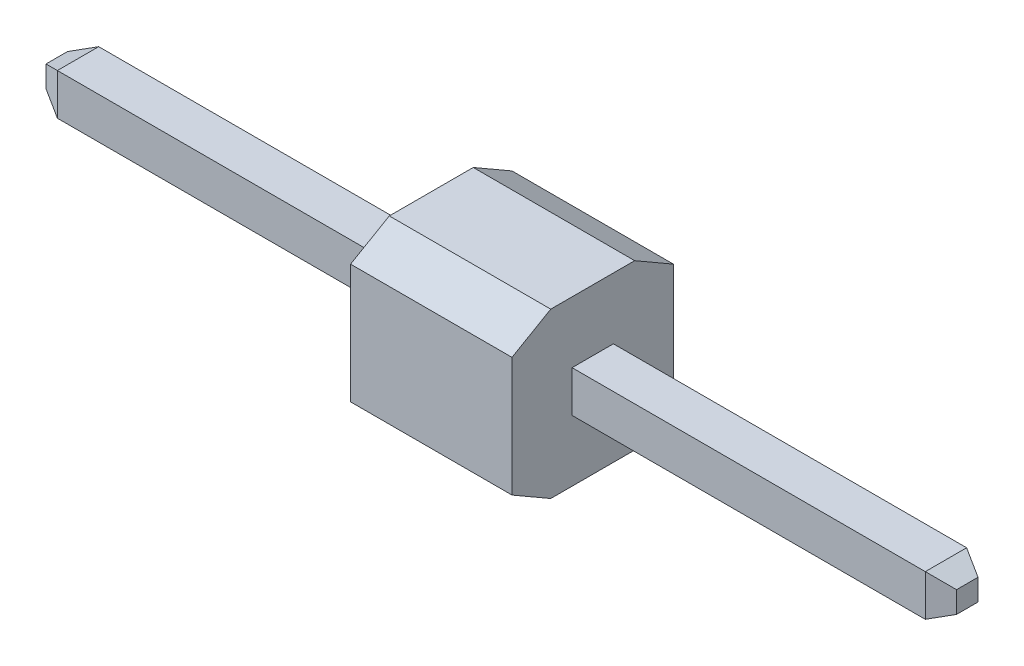
ISO-10303-21;
HEADER;
FILE_DESCRIPTION(('STEP AP214'),'2;1');
FILE_NAME('part.step','',(''),(''),'','','');
FILE_SCHEMA(('AUTOMOTIVE_DESIGN { 1 0 10303 214 1 1 1 1 }'));
ENDSEC;
DATA;
#1=APPLICATION_CONTEXT('core data for automotive mechanical design processes');
#2=APPLICATION_PROTOCOL_DEFINITION('international standard','automotive_design',2000,#1);
#3=PRODUCT_CONTEXT('',#1,'mechanical');
#4=PRODUCT('Part','Part','',(#3));
#5=PRODUCT_RELATED_PRODUCT_CATEGORY('part','',(#4));
#6=PRODUCT_DEFINITION_FORMATION('','',#4);
#7=PRODUCT_DEFINITION_CONTEXT('part definition',#1,'design');
#8=PRODUCT_DEFINITION('design','',#6,#7);
#9=PRODUCT_DEFINITION_SHAPE('','',#8);
#10=(LENGTH_UNIT() NAMED_UNIT(*) SI_UNIT(.MILLI.,.METRE.));
#11=(NAMED_UNIT(*) PLANE_ANGLE_UNIT() SI_UNIT($,.RADIAN.));
#12=(NAMED_UNIT(*) SI_UNIT($,.STERADIAN.) SOLID_ANGLE_UNIT());
#13=UNCERTAINTY_MEASURE_WITH_UNIT(LENGTH_MEASURE(1.E-05),#10,'distance_accuracy_value','');
#14=(GEOMETRIC_REPRESENTATION_CONTEXT(3) GLOBAL_UNCERTAINTY_ASSIGNED_CONTEXT((#13)) GLOBAL_UNIT_ASSIGNED_CONTEXT((#10,
#11,#12)) REPRESENTATION_CONTEXT('',''));
#15=CARTESIAN_POINT('',(0.,0.,0.));
#16=DIRECTION('',(0.,0.,1.));
#17=DIRECTION('',(1.,0.,0.));
#18=AXIS2_PLACEMENT_3D('',#15,#16,#17);
#19=CARTESIAN_POINT('',(5.42107716618497,15.5571157260571,-2.77112192788788));
#20=DIRECTION('',(1.,-9.93476518829084E-08,4.37113882867379E-08));
#21=DIRECTION('',(-9.93476589883358E-08,-1.,8.74227765734759E-08));
#22=AXIS2_PLACEMENT_3D('',#19,#20,#21);
#23=PLANE('',#22);
#24=DIRECTION('',(-1.18186632779336E-08,-0.500000075710541,-0.866025360072933));
#25=VECTOR('',#24,1.);
#26=CARTESIAN_POINT('',(5.42107697401036,14.3135260248209,-1.2011218191698));
#27=LINE('',#26,#25);
#28=CARTESIAN_POINT('',(5.42107697401036,14.3135260248209,-1.2011218191698));
#29=VERTEX_POINT('',#28);
#30=CARTESIAN_POINT('',(5.42107696582215,13.9671158108572,-1.80112178888567));
#31=VERTEX_POINT('',#30);
#32=EDGE_CURVE('E11',#29,#31,#27,.T.);
#33=ORIENTED_EDGE('',*,*,#32,.T.);
#34=DIRECTION('',(4.37113811813104E-08,-8.74227842254741E-08,-0.999999999999995));
#35=VECTOR('',#34,1.);
#36=CARTESIAN_POINT('',(5.42107696582215,13.9671158108572,-1.80112178888567));
#37=LINE('',#36,#35);
#38=CARTESIAN_POINT('',(5.42107702264695,13.9671156972076,-3.10112178888567));
#39=VERTEX_POINT('',#38);
#40=EDGE_CURVE('E304',#31,#39,#37,.T.);
#41=ORIENTED_EDGE('',*,*,#40,.T.);
#42=DIRECTION('',(8.75289963531795E-08,0.499999924289839,-0.866025447495711));
#43=VECTOR('',#42,1.);
#44=CARTESIAN_POINT('',(5.42107702264695,13.9671156972076,-3.10112178888567));
#45=LINE('',#44,#43);
#46=CARTESIAN_POINT('',(5.42107708328881,14.313525806264,-3.7011218191698));
#47=VERTEX_POINT('',#46);
#48=EDGE_CURVE('E296',#39,#47,#45,.T.);
#49=ORIENTED_EDGE('',*,*,#48,.T.);
#50=DIRECTION('',(9.93476588436476E-08,0.999999999999991,-8.74227767226933E-08));
#51=VECTOR('',#50,1.);
#52=CARTESIAN_POINT('',(5.42107708328881,14.313525806264,-3.7011218191698));
#53=LINE('',#52,#51);
#54=CARTESIAN_POINT('',(5.42107726680179,16.160705483234,-3.70112198065538));
#55=VERTEX_POINT('',#54);
#56=EDGE_CURVE('E281',#47,#55,#53,.T.);
#57=ORIENTED_EDGE('',*,*,#56,.T.);
#58=DIRECTION('',(-1.18186619958731E-08,-0.500000075710537,-0.866025360072935));
#59=VECTOR('',#58,1.);
#60=CARTESIAN_POINT('',(5.42107727499,16.5071156972076,-3.10112201093952));
#61=LINE('',#60,#59);
#62=CARTESIAN_POINT('',(5.42107727499,16.5071156972076,-3.10112201093952));
#63=VERTEX_POINT('',#62);
#64=EDGE_CURVE('E265',#63,#55,#61,.T.);
#65=ORIENTED_EDGE('',*,*,#64,.F.);
#66=DIRECTION('',(4.37113811813104E-08,-8.74227842254741E-08,-0.999999999999995));
#67=VECTOR('',#66,1.);
#68=CARTESIAN_POINT('',(5.42107721816521,16.5071158108572,-1.80112201093952));
#69=LINE('',#68,#67);
#70=CARTESIAN_POINT('',(5.42107721816521,16.5071158108572,-1.80112201093952));
#71=VERTEX_POINT('',#70);
#72=EDGE_CURVE('E248',#71,#63,#69,.T.);
#73=ORIENTED_EDGE('',*,*,#72,.F.);
#74=DIRECTION('',(8.7528996352548E-08,0.499999924289832,-0.866025447495716));
#75=VECTOR('',#74,1.);
#76=CARTESIAN_POINT('',(5.42107715752334,16.1607057017909,-1.20112198065538));
#77=LINE('',#76,#75);
#78=CARTESIAN_POINT('',(5.42107715752334,16.1607057017909,-1.20112198065538));
#79=VERTEX_POINT('',#78);
#80=EDGE_CURVE('E242',#79,#71,#77,.T.);
#81=ORIENTED_EDGE('',*,*,#80,.F.);
#82=DIRECTION('',(9.93476588436476E-08,0.999999999999991,-8.74227762418639E-08));
#83=VECTOR('',#82,1.);
#84=CARTESIAN_POINT('',(5.42107697401036,14.3135260248209,-1.2011218191698));
#85=LINE('',#84,#83);
#86=EDGE_CURVE('E236',#29,#79,#85,.T.);
#87=ORIENTED_EDGE('',*,*,#86,.F.);
#88=EDGE_LOOP('',(#33,#41,#49,#57,#65,#73,#81,#87));
#89=FACE_BOUND('',#88,.T.);
#90=DIRECTION('',(-4.37113817364219E-08,8.74227856773042E-08,0.999999999999995));
#91=VECTOR('',#90,1.);
#92=CARTESIAN_POINT('',(5.42107710260247,14.9171157260571,-2.7711218719373));
#93=LINE('',#92,#91);
#94=CARTESIAN_POINT('',(5.42107710260247,14.9171157260571,-2.7711218719373));
#95=VERTEX_POINT('',#94);
#96=CARTESIAN_POINT('',(5.42107707462718,14.9171157820077,-2.1311218719373));
#97=VERTEX_POINT('',#96);
#98=EDGE_CURVE('E302',#95,#97,#93,.T.);
#99=ORIENTED_EDGE('',*,*,#98,.T.);
#100=DIRECTION('',(-9.93476592658906E-08,-0.999999999999991,8.74227766567418E-08));
#101=VECTOR('',#100,1.);
#102=CARTESIAN_POINT('',(5.42107713820968,15.5571157820077,-2.13112192788788));
#103=LINE('',#102,#101);
#104=CARTESIAN_POINT('',(5.42107713820968,15.5571157820077,-2.13112192788788));
#105=VERTEX_POINT('',#104);
#106=EDGE_CURVE('E293',#105,#97,#103,.T.);
#107=ORIENTED_EDGE('',*,*,#106,.F.);
#108=DIRECTION('',(-4.37113817364219E-08,8.74227912284194E-08,0.999999999999995));
#109=VECTOR('',#108,1.);
#110=CARTESIAN_POINT('',(5.42107716618497,15.5571157260571,-2.77112192788788));
#111=LINE('',#110,#109);
#112=CARTESIAN_POINT('',(5.42107716618497,15.5571157260571,-2.77112192788788));
#113=VERTEX_POINT('',#112);
#114=EDGE_CURVE('E278',#113,#105,#111,.T.);
#115=ORIENTED_EDGE('',*,*,#114,.F.);
#116=DIRECTION('',(-9.93476592658906E-08,-0.999999999999991,8.74227759628524E-08));
#117=VECTOR('',#116,1.);
#118=CARTESIAN_POINT('',(5.42107716618497,15.5571157260571,-2.77112192788788));
#119=LINE('',#118,#117);
#120=EDGE_CURVE('E263',#113,#95,#119,.T.);
#121=ORIENTED_EDGE('',*,*,#120,.T.);
#122=EDGE_LOOP('',(#99,#107,#115,#121));
#123=FACE_BOUND('',#122,.T.);
#124=ADVANCED_FACE('F17',(#89,#123),#23,.T.);
#125=CARTESIAN_POINT('',(2.92107716618497,15.5571159744263,-2.77112203716635));
#126=DIRECTION('',(1.,-9.93476518829084E-08,4.37113882867379E-08));
#127=DIRECTION('',(-9.93476589883358E-08,-1.,8.74227765734759E-08));
#128=AXIS2_PLACEMENT_3D('',#125,#126,#127);
#129=PLANE('',#128);
#130=DIRECTION('',(-1.18186632779336E-08,-0.500000075710541,-0.866025360072933));
#131=VECTOR('',#130,1.);
#132=CARTESIAN_POINT('',(2.92107697401036,14.31352627319,-1.20112192844828));
#133=LINE('',#132,#131);
#134=CARTESIAN_POINT('',(2.92107697401036,14.31352627319,-1.20112192844828));
#135=VERTEX_POINT('',#134);
#136=CARTESIAN_POINT('',(2.92107696582215,13.9671160592264,-1.80112189816414));
#137=VERTEX_POINT('',#136);
#138=EDGE_CURVE('E24',#135,#137,#133,.T.);
#139=ORIENTED_EDGE('',*,*,#138,.F.);
#140=DIRECTION('',(9.93476588436476E-08,0.999999999999991,-8.74227762418639E-08));
#141=VECTOR('',#140,1.);
#142=CARTESIAN_POINT('',(2.92107697401036,14.31352627319,-1.20112192844828));
#143=LINE('',#142,#141);
#144=CARTESIAN_POINT('',(2.92107715752334,16.16070595016,-1.20112208993385));
#145=VERTEX_POINT('',#144);
#146=EDGE_CURVE('E300',#135,#145,#143,.T.);
#147=ORIENTED_EDGE('',*,*,#146,.T.);
#148=DIRECTION('',(8.7528996352548E-08,0.499999924289832,-0.866025447495716));
#149=VECTOR('',#148,1.);
#150=CARTESIAN_POINT('',(2.92107715752334,16.16070595016,-1.20112208993385));
#151=LINE('',#150,#149);
#152=CARTESIAN_POINT('',(2.92107721816521,16.5071160592264,-1.80112212021799));
#153=VERTEX_POINT('',#152);
#154=EDGE_CURVE('E286',#145,#153,#151,.T.);
#155=ORIENTED_EDGE('',*,*,#154,.T.);
#156=DIRECTION('',(4.37113811813104E-08,-8.74227842254741E-08,-0.999999999999995));
#157=VECTOR('',#156,1.);
#158=CARTESIAN_POINT('',(2.92107721816521,16.5071160592264,-1.80112212021799));
#159=LINE('',#158,#157);
#160=CARTESIAN_POINT('',(2.92107727499,16.5071159455768,-3.10112212021799));
#161=VERTEX_POINT('',#160);
#162=EDGE_CURVE('E271',#153,#161,#159,.T.);
#163=ORIENTED_EDGE('',*,*,#162,.T.);
#164=DIRECTION('',(-1.18186626368607E-08,-0.500000075710537,-0.866025360072935));
#165=VECTOR('',#164,1.);
#166=CARTESIAN_POINT('',(2.92107727499,16.5071159455768,-3.10112212021799));
#167=LINE('',#166,#165);
#168=CARTESIAN_POINT('',(2.92107726680179,16.1607057316031,-3.70112208993385));
#169=VERTEX_POINT('',#168);
#170=EDGE_CURVE('E253',#161,#169,#167,.T.);
#171=ORIENTED_EDGE('',*,*,#170,.T.);
#172=DIRECTION('',(9.93476588436476E-08,0.999999999999991,-8.74227767226933E-08));
#173=VECTOR('',#172,1.);
#174=CARTESIAN_POINT('',(2.92107708328881,14.3135260546331,-3.70112192844828));
#175=LINE('',#174,#173);
#176=CARTESIAN_POINT('',(2.92107708328881,14.3135260546331,-3.70112192844828));
#177=VERTEX_POINT('',#176);
#178=EDGE_CURVE('E261',#177,#169,#175,.T.);
#179=ORIENTED_EDGE('',*,*,#178,.F.);
#180=DIRECTION('',(8.75289963531795E-08,0.499999924289839,-0.866025447495711));
#181=VECTOR('',#180,1.);
#182=CARTESIAN_POINT('',(2.92107702264695,13.9671159455768,-3.10112189816414));
#183=LINE('',#182,#181);
#184=CARTESIAN_POINT('',(2.92107702264695,13.9671159455768,-3.10112189816414));
#185=VERTEX_POINT('',#184);
#186=EDGE_CURVE('E276',#185,#177,#183,.T.);
#187=ORIENTED_EDGE('',*,*,#186,.F.);
#188=DIRECTION('',(4.37113811813104E-08,-8.74227842254741E-08,-0.999999999999995));
#189=VECTOR('',#188,1.);
#190=CARTESIAN_POINT('',(2.92107696582215,13.9671160592264,-1.80112189816414));
#191=LINE('',#190,#189);
#192=EDGE_CURVE('E291',#137,#185,#191,.T.);
#193=ORIENTED_EDGE('',*,*,#192,.F.);
#194=EDGE_LOOP('',(#139,#147,#155,#163,#171,#179,#187,#193));
#195=FACE_BOUND('',#194,.T.);
#196=DIRECTION('',(-9.93476585720012E-08,-0.999999999999991,8.74227766567418E-08));
#197=VECTOR('',#196,1.);
#198=CARTESIAN_POINT('',(2.92107713820968,15.5571160303769,-2.13112203716635));
#199=LINE('',#198,#197);
#200=CARTESIAN_POINT('',(2.92107713820968,15.5571160303769,-2.13112203716635));
#201=VERTEX_POINT('',#200);
#202=CARTESIAN_POINT('',(2.92107707462718,14.9171160303769,-2.13112198121578));
#203=VERTEX_POINT('',#202);
#204=EDGE_CURVE('E298',#201,#203,#199,.T.);
#205=ORIENTED_EDGE('',*,*,#204,.T.);
#206=DIRECTION('',(-4.37113810425325E-08,8.74227856773042E-08,0.999999999999995));
#207=VECTOR('',#206,1.);
#208=CARTESIAN_POINT('',(2.92107710260247,14.9171159744263,-2.77112198121578));
#209=LINE('',#208,#207);
#210=CARTESIAN_POINT('',(2.92107710260247,14.9171159744263,-2.77112198121578));
#211=VERTEX_POINT('',#210);
#212=EDGE_CURVE('E283',#211,#203,#209,.T.);
#213=ORIENTED_EDGE('',*,*,#212,.F.);
#214=DIRECTION('',(-9.93476592658906E-08,-0.999999999999991,8.74227759628524E-08));
#215=VECTOR('',#214,1.);
#216=CARTESIAN_POINT('',(2.92107716618497,15.5571159744263,-2.77112203716635));
#217=LINE('',#216,#215);
#218=CARTESIAN_POINT('',(2.92107716618497,15.5571159744263,-2.77112203716635));
#219=VERTEX_POINT('',#218);
#220=EDGE_CURVE('E268',#219,#211,#217,.T.);
#221=ORIENTED_EDGE('',*,*,#220,.F.);
#222=DIRECTION('',(-4.37113817364219E-08,8.74227912284194E-08,0.999999999999995));
#223=VECTOR('',#222,1.);
#224=CARTESIAN_POINT('',(2.92107716618497,15.5571159744263,-2.77112203716635));
#225=LINE('',#224,#223);
#226=EDGE_CURVE('E251',#219,#201,#225,.T.);
#227=ORIENTED_EDGE('',*,*,#226,.T.);
#228=EDGE_LOOP('',(#205,#213,#221,#227));
#229=FACE_BOUND('',#228,.T.);
#230=ADVANCED_FACE('F314',(#195,#229),#129,.F.);
#231=CARTESIAN_POINT('',(5.42107697401036,14.3135260248209,-1.2011218191698));
#232=DIRECTION('',(1.07893287081065E-07,0.866025360072937,-0.500000075710535));
#233=DIRECTION('',(1.18186629566715E-08,0.500000075710542,0.866025360072941));
#234=AXIS2_PLACEMENT_3D('',#231,#232,#233);
#235=PLANE('',#234);
#236=ORIENTED_EDGE('',*,*,#138,.T.);
#237=DIRECTION('',(-0.999999999999994,9.93476490407369E-08,-4.37113882867377E-08));
#238=VECTOR('',#237,1.);
#239=CARTESIAN_POINT('',(5.42107696582215,13.9671158108572,-1.80112178888567));
#240=LINE('',#239,#238);
#241=EDGE_CURVE('E288',#31,#137,#240,.T.);
#242=ORIENTED_EDGE('',*,*,#241,.F.);
#243=ORIENTED_EDGE('',*,*,#32,.F.);
#244=DIRECTION('',(-0.999999999999994,9.93476533039933E-08,-4.3711388109102E-08));
#245=VECTOR('',#244,1.);
#246=CARTESIAN_POINT('',(5.42107697401036,14.3135260248209,-1.2011218191698));
#247=LINE('',#246,#245);
#248=EDGE_CURVE('E256',#29,#135,#247,.T.);
#249=ORIENTED_EDGE('',*,*,#248,.T.);
#250=EDGE_LOOP('',(#236,#242,#243,#249));
#251=FACE_BOUND('',#250,.T.);
#252=ADVANCED_FACE('F306',(#251),#235,.F.);
#253=CARTESIAN_POINT('',(5.42107696582215,13.9671158108572,-1.80112178888567));
#254=DIRECTION('',(9.93476589883358E-08,1.,-8.74227765734759E-08));
#255=DIRECTION('',(1.,-9.93476518829084E-08,4.37113882867379E-08));
#256=AXIS2_PLACEMENT_3D('',#253,#254,#255);
#257=PLANE('',#256);
#258=ORIENTED_EDGE('',*,*,#192,.T.);
#259=DIRECTION('',(-0.999999999999994,9.93476490407369E-08,-4.37113882867377E-08));
#260=VECTOR('',#259,1.);
#261=CARTESIAN_POINT('',(5.42107702264695,13.9671156972076,-3.10112178888567));
#262=LINE('',#261,#260);
#263=EDGE_CURVE('E273',#39,#185,#262,.T.);
#264=ORIENTED_EDGE('',*,*,#263,.F.);
#265=ORIENTED_EDGE('',*,*,#40,.F.);
#266=ORIENTED_EDGE('',*,*,#241,.T.);
#267=EDGE_LOOP('',(#258,#264,#265,#266));
#268=FACE_BOUND('',#267,.T.);
#269=ADVANCED_FACE('F311',(#268),#257,.F.);
#270=CARTESIAN_POINT('',(5.42107702264695,13.9671156972076,-3.10112178888567));
#271=DIRECTION('',(6.41819058997377E-08,0.866025447495721,0.499999924289845));
#272=DIRECTION('',(-8.7528996031702E-08,-0.499999924289838,0.866025447495717));
#273=AXIS2_PLACEMENT_3D('',#270,#271,#272);
#274=PLANE('',#273);
#275=ORIENTED_EDGE('',*,*,#186,.T.);
#276=DIRECTION('',(-0.999999999999994,9.93476533039933E-08,-4.37113884643734E-08));
#277=VECTOR('',#276,1.);
#278=CARTESIAN_POINT('',(5.42107708328881,14.313525806264,-3.7011218191698));
#279=LINE('',#278,#277);
#280=EDGE_CURVE('E258',#47,#177,#279,.T.);
#281=ORIENTED_EDGE('',*,*,#280,.F.);
#282=ORIENTED_EDGE('',*,*,#48,.F.);
#283=ORIENTED_EDGE('',*,*,#263,.T.);
#284=EDGE_LOOP('',(#275,#281,#282,#283));
#285=FACE_BOUND('',#284,.T.);
#286=ADVANCED_FACE('F319',(#285),#274,.F.);
#287=CARTESIAN_POINT('',(5.42107708328881,14.313525806264,-3.7011218191698));
#288=DIRECTION('',(-4.37113811813106E-08,8.74227836789032E-08,1.));
#289=DIRECTION('',(-1.,9.93476518829084E-08,-4.37113882867379E-08));
#290=AXIS2_PLACEMENT_3D('',#287,#288,#289);
#291=PLANE('',#290);
#292=ORIENTED_EDGE('',*,*,#178,.T.);
#293=DIRECTION('',(-0.999999999999994,9.93476533039933E-08,-4.37113882867377E-08));
#294=VECTOR('',#293,1.);
#295=CARTESIAN_POINT('',(5.42107726680179,16.160705483234,-3.70112198065538));
#296=LINE('',#295,#294);
#297=EDGE_CURVE('E245',#55,#169,#296,.T.);
#298=ORIENTED_EDGE('',*,*,#297,.F.);
#299=ORIENTED_EDGE('',*,*,#56,.F.);
#300=ORIENTED_EDGE('',*,*,#280,.T.);
#301=EDGE_LOOP('',(#292,#298,#299,#300));
#302=FACE_BOUND('',#301,.T.);
#303=ADVANCED_FACE('F326',(#302),#291,.F.);
#304=CARTESIAN_POINT('',(5.42107727499,16.5071156972076,-3.10112201093952));
#305=DIRECTION('',(1.07893287081065E-07,0.866025360072937,-0.500000075710535));
#306=DIRECTION('',(1.18186629566715E-08,0.500000075710542,0.866025360072941));
#307=AXIS2_PLACEMENT_3D('',#304,#305,#306);
#308=PLANE('',#307);
#309=ORIENTED_EDGE('',*,*,#170,.F.);
#310=DIRECTION('',(-0.999999999999994,9.93476490407369E-08,-4.37113882867377E-08));
#311=VECTOR('',#310,1.);
#312=CARTESIAN_POINT('',(5.42107727499,16.5071156972076,-3.10112201093952));
#313=LINE('',#312,#311);
#314=EDGE_CURVE('E239',#63,#161,#313,.T.);
#315=ORIENTED_EDGE('',*,*,#314,.F.);
#316=ORIENTED_EDGE('',*,*,#64,.T.);
#317=ORIENTED_EDGE('',*,*,#297,.T.);
#318=EDGE_LOOP('',(#309,#315,#316,#317));
#319=FACE_BOUND('',#318,.T.);
#320=ADVANCED_FACE('F329',(#319),#308,.T.);
#321=CARTESIAN_POINT('',(5.42107721816521,16.5071158108572,-1.80112201093952));
#322=DIRECTION('',(9.93476589883358E-08,1.,-8.74227765734759E-08));
#323=DIRECTION('',(1.,-9.93476518829084E-08,4.37113882867379E-08));
#324=AXIS2_PLACEMENT_3D('',#321,#322,#323);
#325=PLANE('',#324);
#326=ORIENTED_EDGE('',*,*,#162,.F.);
#327=DIRECTION('',(-0.999999999999994,9.93476490407369E-08,-4.37113883755555E-08));
#328=VECTOR('',#327,1.);
#329=CARTESIAN_POINT('',(5.42107721816521,16.5071158108572,-1.80112201093952));
#330=LINE('',#329,#328);
#331=EDGE_CURVE('E233',#71,#153,#330,.T.);
#332=ORIENTED_EDGE('',*,*,#331,.F.);
#333=ORIENTED_EDGE('',*,*,#72,.T.);
#334=ORIENTED_EDGE('',*,*,#314,.T.);
#335=EDGE_LOOP('',(#326,#332,#333,#334));
#336=FACE_BOUND('',#335,.T.);
#337=ADVANCED_FACE('F333',(#336),#325,.T.);
#338=CARTESIAN_POINT('',(5.42107715752334,16.1607057017909,-1.20112198065538));
#339=DIRECTION('',(6.41819058997377E-08,0.866025447495721,0.499999924289845));
#340=DIRECTION('',(-8.7528996031702E-08,-0.499999924289838,0.866025447495717));
#341=AXIS2_PLACEMENT_3D('',#338,#339,#340);
#342=PLANE('',#341);
#343=ORIENTED_EDGE('',*,*,#154,.F.);
#344=DIRECTION('',(-0.999999999999994,9.93476533039933E-08,-4.3711388109102E-08));
#345=VECTOR('',#344,1.);
#346=CARTESIAN_POINT('',(5.42107715752334,16.1607057017909,-1.20112198065538));
#347=LINE('',#346,#345);
#348=EDGE_CURVE('E230',#79,#145,#347,.T.);
#349=ORIENTED_EDGE('',*,*,#348,.F.);
#350=ORIENTED_EDGE('',*,*,#80,.T.);
#351=ORIENTED_EDGE('',*,*,#331,.T.);
#352=EDGE_LOOP('',(#343,#349,#350,#351));
#353=FACE_BOUND('',#352,.T.);
#354=ADVANCED_FACE('F337',(#353),#342,.T.);
#355=CARTESIAN_POINT('',(5.42107697401036,14.3135260248209,-1.2011218191698));
#356=DIRECTION('',(-4.37113811813106E-08,8.74227835615132E-08,1.));
#357=DIRECTION('',(-9.93476589883358E-08,-1.,8.74227764560859E-08));
#358=AXIS2_PLACEMENT_3D('',#355,#356,#357);
#359=PLANE('',#358);
#360=ORIENTED_EDGE('',*,*,#146,.F.);
#361=ORIENTED_EDGE('',*,*,#248,.F.);
#362=ORIENTED_EDGE('',*,*,#86,.T.);
#363=ORIENTED_EDGE('',*,*,#348,.T.);
#364=EDGE_LOOP('',(#360,#361,#362,#363));
#365=FACE_BOUND('',#364,.T.);
#366=ADVANCED_FACE('F339',(#365),#359,.T.);
#367=CARTESIAN_POINT('',(-2.87892283381503,15.5571165506427,-2.7711222906924));
#368=DIRECTION('',(-1.,9.93476518829084E-08,-4.37113882867379E-08));
#369=DIRECTION('',(9.93476589883358E-08,1.,-8.74227765734759E-08));
#370=AXIS2_PLACEMENT_3D('',#367,#368,#369);
#371=PLANE('',#370);
#372=DIRECTION('',(9.93476554744636E-08,0.999999999999991,-8.7422776141512E-08));
#373=VECTOR('',#372,1.);
#374=CARTESIAN_POINT('',(-2.87892290335867,15.0709981203305,-2.28500377538558));
#375=LINE('',#374,#373);
#376=CARTESIAN_POINT('',(-2.87892290335867,15.0709981203305,-2.28500377538558));
#377=VERTEX_POINT('',#376);
#378=CARTESIAN_POINT('',(-2.87892287035171,15.4032350659405,-2.28500380443065));
#379=VERTEX_POINT('',#378);
#380=EDGE_CURVE('E228',#377,#379,#375,.T.);
#381=ORIENTED_EDGE('',*,*,#380,.T.);
#382=DIRECTION('',(4.37113820547149E-08,-8.74227854960561E-08,-0.999999999999995));
#383=VECTOR('',#382,1.);
#384=CARTESIAN_POINT('',(-2.87892287035171,15.4032350659405,-2.28500380443065));
#385=LINE('',#384,#383);
#386=CARTESIAN_POINT('',(-2.87892285582917,15.4032350368954,-2.61724075004865));
#387=VERTEX_POINT('',#386);
#388=EDGE_CURVE('E223',#379,#387,#385,.T.);
#389=ORIENTED_EDGE('',*,*,#388,.T.);
#390=DIRECTION('',(-9.93476581477919E-08,-0.999999999999991,8.7422776141512E-08));
#391=VECTOR('',#390,1.);
#392=CARTESIAN_POINT('',(-2.87892285582917,15.4032350368954,-2.61724075004865));
#393=LINE('',#392,#391);
#394=CARTESIAN_POINT('',(-2.87892288883614,15.0709980912854,-2.61724072100358));
#395=VERTEX_POINT('',#394);
#396=EDGE_CURVE('E215',#387,#395,#393,.T.);
#397=ORIENTED_EDGE('',*,*,#396,.T.);
#398=DIRECTION('',(-4.37113740347301E-08,8.74227641094299E-08,0.999999999999995));
#399=VECTOR('',#398,1.);
#400=CARTESIAN_POINT('',(-2.87892288883614,15.0709980912854,-2.61724072100358));
#401=LINE('',#400,#399);
#402=EDGE_CURVE('E207',#395,#377,#401,.T.);
#403=ORIENTED_EDGE('',*,*,#402,.T.);
#404=EDGE_LOOP('',(#381,#389,#397,#403));
#405=FACE_BOUND('',#404,.T.);
#406=ADVANCED_FACE('F341',(#405),#371,.T.);
#407=CARTESIAN_POINT('',(-2.87892283381503,15.5571165506427,-2.7711222906924));
#408=DIRECTION('',(9.93476589883358E-08,1.,-8.74227764510112E-08));
#409=DIRECTION('',(-4.37113811813106E-08,8.74227835564385E-08,1.));
#410=AXIS2_PLACEMENT_3D('',#407,#408,#409);
#411=PLANE('',#410);
#412=DIRECTION('',(0.999999999999994,-9.93476527532252E-08,4.37113883581816E-08));
#413=VECTOR('',#412,1.);
#414=CARTESIAN_POINT('',(-2.54892283381503,15.5571165178579,-2.77112227626765));
#415=LINE('',#414,#413);
#416=CARTESIAN_POINT('',(-2.54892283381503,15.5571165178579,-2.77112227626765));
#417=VERTEX_POINT('',#416);
#418=EDGE_CURVE('E225',#417,#219,#415,.T.);
#419=ORIENTED_EDGE('',*,*,#418,.F.);
#420=DIRECTION('',(-4.37113817364219E-08,8.74227912284193E-08,0.999999999999995));
#421=VECTOR('',#420,1.);
#422=CARTESIAN_POINT('',(-2.54892283381503,15.5571165178579,-2.77112227626765));
#423=LINE('',#422,#421);
#424=CARTESIAN_POINT('',(-2.54892286179031,15.5571165738085,-2.13112227626765));
#425=VERTEX_POINT('',#424);
#426=EDGE_CURVE('E217',#417,#425,#423,.T.);
#427=ORIENTED_EDGE('',*,*,#426,.T.);
#428=DIRECTION('',(0.999999999999994,-9.93476527532252E-08,4.37113882769953E-08));
#429=VECTOR('',#428,1.);
#430=CARTESIAN_POINT('',(-2.54892286179031,15.5571165738085,-2.13112227626765));
#431=LINE('',#430,#429);
#432=EDGE_CURVE('E220',#425,#201,#431,.T.);
#433=ORIENTED_EDGE('',*,*,#432,.T.);
#434=ORIENTED_EDGE('',*,*,#226,.F.);
#435=EDGE_LOOP('',(#419,#427,#433,#434));
#436=FACE_BOUND('',#435,.T.);
#437=ADVANCED_FACE('F348',(#436),#411,.T.);
#438=CARTESIAN_POINT('',(-2.87892286179031,15.5571166065932,-2.1311222906924));
#439=DIRECTION('',(-4.37113811813106E-08,8.74227836789032E-08,1.));
#440=DIRECTION('',(-1.,9.93476518829084E-08,-4.37113882867379E-08));
#441=AXIS2_PLACEMENT_3D('',#438,#439,#440);
#442=PLANE('',#441);
#443=ORIENTED_EDGE('',*,*,#432,.F.);
#444=DIRECTION('',(-9.93476592658906E-08,-0.999999999999991,8.74227766567418E-08));
#445=VECTOR('',#444,1.);
#446=CARTESIAN_POINT('',(-2.54892286179031,15.5571165738085,-2.13112227626765));
#447=LINE('',#446,#445);
#448=CARTESIAN_POINT('',(-2.54892292537282,14.9171165738085,-2.13112222031707));
#449=VERTEX_POINT('',#448);
#450=EDGE_CURVE('E209',#425,#449,#447,.T.);
#451=ORIENTED_EDGE('',*,*,#450,.T.);
#452=DIRECTION('',(0.999999999999994,-9.93476495057721E-08,4.3711388195809E-08));
#453=VECTOR('',#452,1.);
#454=CARTESIAN_POINT('',(-2.54892292537282,14.9171165738085,-2.13112222031707));
#455=LINE('',#454,#453);
#456=EDGE_CURVE('E212',#449,#203,#455,.T.);
#457=ORIENTED_EDGE('',*,*,#456,.T.);
#458=ORIENTED_EDGE('',*,*,#204,.F.);
#459=EDGE_LOOP('',(#443,#451,#457,#458));
#460=FACE_BOUND('',#459,.T.);
#461=ADVANCED_FACE('F424',(#460),#442,.T.);
#462=CARTESIAN_POINT('',(-2.87892289739753,14.9171165506427,-2.77112223474183));
#463=DIRECTION('',(9.93476589883357E-08,1.,-8.74227764040693E-08));
#464=DIRECTION('',(-4.37113811813106E-08,8.74227835094966E-08,1.));
#465=AXIS2_PLACEMENT_3D('',#462,#463,#464);
#466=PLANE('',#465);
#467=ORIENTED_EDGE('',*,*,#456,.F.);
#468=DIRECTION('',(4.37113831242006E-08,-8.74227912284193E-08,-0.999999999999995));
#469=VECTOR('',#468,1.);
#470=CARTESIAN_POINT('',(-2.54892292537282,14.9171165738085,-2.13112222031707));
#471=LINE('',#470,#469);
#472=CARTESIAN_POINT('',(-2.54892289739753,14.9171165178579,-2.77112222031707));
#473=VERTEX_POINT('',#472);
#474=EDGE_CURVE('E201',#449,#473,#471,.T.);
#475=ORIENTED_EDGE('',*,*,#474,.T.);
#476=DIRECTION('',(0.999999999999994,-9.93476495057722E-08,4.37113882769953E-08));
#477=VECTOR('',#476,1.);
#478=CARTESIAN_POINT('',(-2.54892289739753,14.9171165178579,-2.77112222031707));
#479=LINE('',#478,#477);
#480=EDGE_CURVE('E204',#473,#211,#479,.T.);
#481=ORIENTED_EDGE('',*,*,#480,.T.);
#482=ORIENTED_EDGE('',*,*,#212,.T.);
#483=EDGE_LOOP('',(#467,#475,#481,#482));
#484=FACE_BOUND('',#483,.T.);
#485=ADVANCED_FACE('F421',(#484),#466,.F.);
#486=CARTESIAN_POINT('',(-2.87892283381503,15.5571165506427,-2.7711222906924));
#487=DIRECTION('',(-4.37113811813106E-08,8.74227836789032E-08,1.));
#488=DIRECTION('',(-1.,9.93476518829084E-08,-4.37113882867379E-08));
#489=AXIS2_PLACEMENT_3D('',#486,#487,#488);
#490=PLANE('',#489);
#491=ORIENTED_EDGE('',*,*,#480,.F.);
#492=DIRECTION('',(9.93476578781118E-08,0.999999999999991,-8.74227766567418E-08));
#493=VECTOR('',#492,1.);
#494=CARTESIAN_POINT('',(-2.54892289739753,14.9171165178579,-2.77112222031707));
#495=LINE('',#494,#493);
#496=EDGE_CURVE('E196',#473,#417,#495,.T.);
#497=ORIENTED_EDGE('',*,*,#496,.T.);
#498=ORIENTED_EDGE('',*,*,#418,.T.);
#499=ORIENTED_EDGE('',*,*,#220,.T.);
#500=EDGE_LOOP('',(#491,#497,#498,#499));
#501=FACE_BOUND('',#500,.T.);
#502=ADVANCED_FACE('F376',(#501),#490,.F.);
#503=CARTESIAN_POINT('',(-2.87892283381503,15.5571165506427,-2.7711222906924));
#504=DIRECTION('',(-4.37113811813106E-08,8.74227836789032E-08,1.));
#505=DIRECTION('',(-1.,9.93476518829084E-08,-4.37113882867379E-08));
#506=AXIS2_PLACEMENT_3D('',#503,#504,#505);
#507=PLANE('',#506);
#508=DIRECTION('',(0.999999999999994,-9.93476469078097E-08,4.37113882769953E-08));
#509=VECTOR('',#508,1.);
#510=CARTESIAN_POINT('',(5.42107716618497,15.5571157260572,-2.77112192788788));
#511=LINE('',#510,#509);
#512=CARTESIAN_POINT('',(10.891077166185,15.5571151826255,-2.77112168878659));
#513=VERTEX_POINT('',#512);
#514=EDGE_CURVE('E199',#113,#513,#511,.T.);
#515=ORIENTED_EDGE('',*,*,#514,.T.);
#516=DIRECTION('',(-9.93476606536693E-08,-0.999999999999991,8.74227766567418E-08));
#517=VECTOR('',#516,1.);
#518=CARTESIAN_POINT('',(10.891077166185,15.5571151826255,-2.77112168878659));
#519=LINE('',#518,#517);
#520=CARTESIAN_POINT('',(10.8910771026025,14.9171151826255,-2.77112163283601));
#521=VERTEX_POINT('',#520);
#522=EDGE_CURVE('E191',#513,#521,#519,.T.);
#523=ORIENTED_EDGE('',*,*,#522,.T.);
#524=DIRECTION('',(0.999999999999994,-9.93476521037346E-08,4.37113883581817E-08));
#525=VECTOR('',#524,1.);
#526=CARTESIAN_POINT('',(5.42107710260247,14.9171157260572,-2.7711218719373));
#527=LINE('',#526,#525);
#528=EDGE_CURVE('E194',#95,#521,#527,.T.);
#529=ORIENTED_EDGE('',*,*,#528,.F.);
#530=ORIENTED_EDGE('',*,*,#120,.F.);
#531=EDGE_LOOP('',(#515,#523,#529,#530));
#532=FACE_BOUND('',#531,.T.);
#533=ADVANCED_FACE('F367',(#532),#507,.F.);
#534=CARTESIAN_POINT('',(-2.87892289739753,14.9171165506427,-2.77112223474183));
#535=DIRECTION('',(9.93476589883357E-08,1.,-8.74227764040693E-08));
#536=DIRECTION('',(-4.37113811813106E-08,8.74227835094966E-08,1.));
#537=AXIS2_PLACEMENT_3D('',#534,#535,#536);
#538=PLANE('',#537);
#539=ORIENTED_EDGE('',*,*,#528,.T.);
#540=DIRECTION('',(-4.37113817364219E-08,8.74227856773043E-08,0.999999999999995));
#541=VECTOR('',#540,1.);
#542=CARTESIAN_POINT('',(10.8910771026025,14.9171151826255,-2.77112163283601));
#543=LINE('',#542,#541);
#544=CARTESIAN_POINT('',(10.8910770746272,14.9171152385761,-2.13112163283601));
#545=VERTEX_POINT('',#544);
#546=EDGE_CURVE('E186',#521,#545,#543,.T.);
#547=ORIENTED_EDGE('',*,*,#546,.T.);
#548=DIRECTION('',(0.999999999999994,-9.93476521037346E-08,4.3711388195809E-08));
#549=VECTOR('',#548,1.);
#550=CARTESIAN_POINT('',(5.42107707462718,14.9171157820077,-2.13112187193731));
#551=LINE('',#550,#549);
#552=EDGE_CURVE('E189',#97,#545,#551,.T.);
#553=ORIENTED_EDGE('',*,*,#552,.F.);
#554=ORIENTED_EDGE('',*,*,#98,.F.);
#555=EDGE_LOOP('',(#539,#547,#553,#554));
#556=FACE_BOUND('',#555,.T.);
#557=ADVANCED_FACE('F364',(#556),#538,.F.);
#558=CARTESIAN_POINT('',(-2.87892286179031,15.5571166065932,-2.1311222906924));
#559=DIRECTION('',(-4.37113811813106E-08,8.74227836789032E-08,1.));
#560=DIRECTION('',(-1.,9.93476518829084E-08,-4.37113882867379E-08));
#561=AXIS2_PLACEMENT_3D('',#558,#559,#560);
#562=PLANE('',#561);
#563=ORIENTED_EDGE('',*,*,#552,.T.);
#564=DIRECTION('',(9.93476578781118E-08,0.999999999999991,-8.74227766567418E-08));
#565=VECTOR('',#564,1.);
#566=CARTESIAN_POINT('',(10.8910770746272,14.9171152385761,-2.13112163283601));
#567=LINE('',#566,#565);
#568=CARTESIAN_POINT('',(10.8910771382097,15.5571152385761,-2.13112168878659));
#569=VERTEX_POINT('',#568);
#570=EDGE_CURVE('E176',#545,#569,#567,.T.);
#571=ORIENTED_EDGE('',*,*,#570,.T.);
#572=DIRECTION('',(0.999999999999994,-9.93476469078097E-08,4.37113880334363E-08));
#573=VECTOR('',#572,1.);
#574=CARTESIAN_POINT('',(5.42107713820968,15.5571157820077,-2.13112192788788));
#575=LINE('',#574,#573);
#576=EDGE_CURVE('E179',#105,#569,#575,.T.);
#577=ORIENTED_EDGE('',*,*,#576,.F.);
#578=ORIENTED_EDGE('',*,*,#106,.T.);
#579=EDGE_LOOP('',(#563,#571,#577,#578));
#580=FACE_BOUND('',#579,.T.);
#581=ADVANCED_FACE('F366',(#580),#562,.T.);
#582=CARTESIAN_POINT('',(-2.87892283381503,15.5571165506427,-2.7711222906924));
#583=DIRECTION('',(9.93476589883358E-08,1.,-8.74227764510112E-08));
#584=DIRECTION('',(-4.37113811813106E-08,8.74227835564385E-08,1.));
#585=AXIS2_PLACEMENT_3D('',#582,#583,#584);
#586=PLANE('',#585);
#587=ORIENTED_EDGE('',*,*,#576,.T.);
#588=DIRECTION('',(4.37113817364219E-08,-8.74227856773043E-08,-0.999999999999995));
#589=VECTOR('',#588,1.);
#590=CARTESIAN_POINT('',(10.8910771382097,15.5571152385761,-2.13112168878659));
#591=LINE('',#590,#589);
#592=EDGE_CURVE('E167',#569,#513,#591,.T.);
#593=ORIENTED_EDGE('',*,*,#592,.T.);
#594=ORIENTED_EDGE('',*,*,#514,.F.);
#595=ORIENTED_EDGE('',*,*,#114,.T.);
#596=EDGE_LOOP('',(#587,#593,#594,#595));
#597=FACE_BOUND('',#596,.T.);
#598=ADVANCED_FACE('F373',(#597),#586,.T.);
#599=CARTESIAN_POINT('',(11.221077166185,15.5571151498408,-2.77112167436183));
#600=DIRECTION('',(-1.,9.93476518829084E-08,-4.37113882867379E-08));
#601=DIRECTION('',(9.93476589883358E-08,1.,-8.74227765734759E-08));
#602=AXIS2_PLACEMENT_3D('',#599,#600,#601);
#603=PLANE('',#602);
#604=DIRECTION('',(-9.93476581477919E-08,-0.999999999999991,8.74227774781761E-08));
#605=VECTOR('',#604,1.);
#606=CARTESIAN_POINT('',(11.2210771296483,15.4032336651386,-2.28500318810008));
#607=LINE('',#606,#605);
#608=CARTESIAN_POINT('',(11.2210771296483,15.4032336651386,-2.28500318810008));
#609=VERTEX_POINT('',#608);
#610=CARTESIAN_POINT('',(11.2210770966413,15.0709967195286,-2.285003159055));
#611=VERTEX_POINT('',#610);
#612=EDGE_CURVE('E153',#609,#611,#607,.T.);
#613=ORIENTED_EDGE('',*,*,#612,.T.);
#614=DIRECTION('',(4.37113820547149E-08,-8.74227854960561E-08,-0.999999999999995));
#615=VECTOR('',#614,1.);
#616=CARTESIAN_POINT('',(11.2210770966413,15.0709967195286,-2.285003159055));
#617=LINE('',#616,#615);
#618=CARTESIAN_POINT('',(11.2210771111639,15.0709966904835,-2.617240104673));
#619=VERTEX_POINT('',#618);
#620=EDGE_CURVE('E395',#611,#619,#617,.T.);
#621=ORIENTED_EDGE('',*,*,#620,.T.);
#622=DIRECTION('',(9.93476581477919E-08,0.999999999999991,-8.74227774781761E-08));
#623=VECTOR('',#622,1.);
#624=CARTESIAN_POINT('',(11.2210771111639,15.0709966904835,-2.617240104673));
#625=LINE('',#624,#623);
#626=CARTESIAN_POINT('',(11.2210771441708,15.4032336360935,-2.61724013371808));
#627=VERTEX_POINT('',#626);
#628=EDGE_CURVE('E156',#619,#627,#625,.T.);
#629=ORIENTED_EDGE('',*,*,#628,.T.);
#630=DIRECTION('',(-4.37113874013715E-08,8.74227641094299E-08,0.999999999999995));
#631=VECTOR('',#630,1.);
#632=CARTESIAN_POINT('',(11.2210771441708,15.4032336360935,-2.61724013371808));
#633=LINE('',#632,#631);
#634=EDGE_CURVE('E149',#627,#609,#633,.T.);
#635=ORIENTED_EDGE('',*,*,#634,.T.);
#636=EDGE_LOOP('',(#613,#621,#629,#635));
#637=FACE_BOUND('',#636,.T.);
#638=ADVANCED_FACE('F151',(#637),#603,.F.);
#639=CARTESIAN_POINT('',(-2.87892288210976,15.0709980778326,-2.77112224819458));
#640=DIRECTION('',(-0.422618351780369,-0.906307745050466,6.07587120833484E-08));
#641=DIRECTION('',(4.37113811813106E-08,-8.74227835094966E-08,-1.));
#642=AXIS2_PLACEMENT_3D('',#639,#640,#641);
#643=PLANE('',#642);
#644=DIRECTION('',(0.834817073788751,-0.389281669540034,0.3892816911581));
#645=VECTOR('',#644,1.);
#646=CARTESIAN_POINT('',(-2.87892290335869,15.07099812033,-2.28500377538606));
#647=LINE('',#646,#645);
#648=EDGE_CURVE('E181',#377,#449,#647,.T.);
#649=ORIENTED_EDGE('',*,*,#648,.F.);
#650=ORIENTED_EDGE('',*,*,#402,.F.);
#651=DIRECTION('',(-0.834817107820826,0.389281737604199,0.389281550111905));
#652=VECTOR('',#651,1.);
#653=CARTESIAN_POINT('',(-2.54892289739796,14.9171165178565,-2.77112222031653));
#654=LINE('',#653,#652);
#655=EDGE_CURVE('E404',#473,#395,#654,.T.);
#656=ORIENTED_EDGE('',*,*,#655,.F.);
#657=ORIENTED_EDGE('',*,*,#474,.F.);
#658=EDGE_LOOP('',(#649,#650,#656,#657));
#659=FACE_BOUND('',#658,.T.);
#660=ADVANCED_FACE('F418',(#659),#643,.T.);
#661=CARTESIAN_POINT('',(-2.8789228405414,15.5571165640954,-2.6172407635014));
#662=DIRECTION('',(-0.422618222124847,-3.72458176658199E-08,-0.906307805509828));
#663=DIRECTION('',(9.93476589883358E-08,1.,-8.74227765734759E-08));
#664=AXIS2_PLACEMENT_3D('',#661,#662,#663);
#665=PLANE('',#664);
#666=ORIENTED_EDGE('',*,*,#655,.T.);
#667=ORIENTED_EDGE('',*,*,#396,.F.);
#668=DIRECTION('',(-0.834817185169261,-0.389281503665787,0.389281618176067));
#669=VECTOR('',#668,1.);
#670=CARTESIAN_POINT('',(-2.54892283381388,15.5571165178552,-2.77112227626792));
#671=LINE('',#670,#669);
#672=EDGE_CURVE('E160',#417,#387,#671,.T.);
#673=ORIENTED_EDGE('',*,*,#672,.F.);
#674=ORIENTED_EDGE('',*,*,#496,.F.);
#675=EDGE_LOOP('',(#666,#667,#673,#674));
#676=FACE_BOUND('',#675,.T.);
#677=ADVANCED_FACE('F434',(#676),#665,.T.);
#678=CARTESIAN_POINT('',(-2.54892286179031,15.5571165738085,-2.13112227626765));
#679=DIRECTION('',(0.422618301356777,-1.21218081559392E-07,-0.906307768563367));
#680=DIRECTION('',(-9.93476589883358E-08,-1.,8.74227765734759E-08));
#681=AXIS2_PLACEMENT_3D('',#678,#679,#680);
#682=PLANE('',#681);
#683=ORIENTED_EDGE('',*,*,#648,.T.);
#684=ORIENTED_EDGE('',*,*,#450,.F.);
#685=DIRECTION('',(0.834817151137182,0.389281571729962,0.389281623093937));
#686=VECTOR('',#685,1.);
#687=CARTESIAN_POINT('',(-2.87892287035455,15.403235065948,-2.28500380443211));
#688=LINE('',#687,#686);
#689=EDGE_CURVE('E170',#379,#425,#688,.T.);
#690=ORIENTED_EDGE('',*,*,#689,.F.);
#691=ORIENTED_EDGE('',*,*,#380,.F.);
#692=EDGE_LOOP('',(#683,#684,#690,#691));
#693=FACE_BOUND('',#692,.T.);
#694=ADVANCED_FACE('F413',(#693),#682,.F.);
#695=CARTESIAN_POINT('',(-2.54892283381503,15.5571165178579,-2.77112227626765));
#696=DIRECTION('',(0.422618171701255,-0.906307829022729,9.770517399793E-08));
#697=DIRECTION('',(-4.37113811813106E-08,8.74227835564385E-08,1.));
#698=AXIS2_PLACEMENT_3D('',#695,#696,#697);
#699=PLANE('',#698);
#700=ORIENTED_EDGE('',*,*,#672,.T.);
#701=ORIENTED_EDGE('',*,*,#388,.F.);
#702=ORIENTED_EDGE('',*,*,#689,.T.);
#703=ORIENTED_EDGE('',*,*,#426,.F.);
#704=EDGE_LOOP('',(#700,#701,#702,#703));
#705=FACE_BOUND('',#704,.T.);
#706=ADVANCED_FACE('F429',(#705),#699,.F.);
#707=CARTESIAN_POINT('',(11.2210771508972,15.4032336226408,-2.77112166090908));
#708=DIRECTION('',(0.422618351780369,0.906307745050466,-6.07587121258922E-08));
#709=DIRECTION('',(4.37113811813106E-08,-8.74227835564385E-08,-1.));
#710=AXIS2_PLACEMENT_3D('',#707,#708,#709);
#711=PLANE('',#710);
#712=DIRECTION('',(-0.834817107820822,0.389281737604209,0.389281550111904));
#713=VECTOR('',#712,1.);
#714=CARTESIAN_POINT('',(11.2210771296483,15.4032336651391,-2.28500318810056));
#715=LINE('',#714,#713);
#716=EDGE_CURVE('E164',#609,#569,#715,.T.);
#717=ORIENTED_EDGE('',*,*,#716,.F.);
#718=ORIENTED_EDGE('',*,*,#634,.F.);
#719=DIRECTION('',(0.834817073788753,-0.389281669540028,0.389281691158102));
#720=VECTOR('',#719,1.);
#721=CARTESIAN_POINT('',(10.891077166185,15.5571151826255,-2.77112168878659));
#722=LINE('',#721,#720);
#723=EDGE_CURVE('E392',#513,#627,#722,.T.);
#724=ORIENTED_EDGE('',*,*,#723,.F.);
#725=ORIENTED_EDGE('',*,*,#592,.F.);
#726=EDGE_LOOP('',(#717,#718,#724,#725));
#727=FACE_BOUND('',#726,.T.);
#728=ADVANCED_FACE('F165',(#727),#711,.T.);
#729=CARTESIAN_POINT('',(10.891077166185,15.5571151826255,-2.77112168878659));
#730=DIRECTION('',(-0.422618301356777,1.21218081559392E-07,0.906307768563367));
#731=DIRECTION('',(-9.93476589883358E-08,-1.,8.74227765734759E-08));
#732=AXIS2_PLACEMENT_3D('',#729,#730,#731);
#733=PLANE('',#732);
#734=ORIENTED_EDGE('',*,*,#723,.T.);
#735=ORIENTED_EDGE('',*,*,#628,.F.);
#736=DIRECTION('',(0.83481715113718,0.389281571729967,0.389281623093936));
#737=VECTOR('',#736,1.);
#738=CARTESIAN_POINT('',(10.891077102604,14.9171151826213,-2.77112163283511));
#739=LINE('',#738,#737);
#740=EDGE_CURVE('E389',#521,#619,#739,.T.);
#741=ORIENTED_EDGE('',*,*,#740,.F.);
#742=ORIENTED_EDGE('',*,*,#522,.F.);
#743=EDGE_LOOP('',(#734,#735,#741,#742));
#744=FACE_BOUND('',#743,.T.);
#745=ADVANCED_FACE('F390',(#744),#733,.F.);
#746=CARTESIAN_POINT('',(11.2210771449361,15.5571151923386,-2.28500320155283));
#747=DIRECTION('',(0.422618222124847,3.72458176658199E-08,0.906307805509828));
#748=DIRECTION('',(9.93476589883358E-08,1.,-8.74227765734759E-08));
#749=AXIS2_PLACEMENT_3D('',#746,#747,#748);
#750=PLANE('',#749);
#751=ORIENTED_EDGE('',*,*,#716,.T.);
#752=ORIENTED_EDGE('',*,*,#570,.F.);
#753=DIRECTION('',(-0.834817185169256,-0.389281503665799,0.389281618176065));
#754=VECTOR('',#753,1.);
#755=CARTESIAN_POINT('',(11.2210770966413,15.0709967195281,-2.28500315905549));
#756=LINE('',#755,#754);
#757=EDGE_CURVE('E175',#611,#545,#756,.T.);
#758=ORIENTED_EDGE('',*,*,#757,.F.);
#759=ORIENTED_EDGE('',*,*,#612,.F.);
#760=EDGE_LOOP('',(#751,#752,#758,#759));
#761=FACE_BOUND('',#760,.T.);
#762=ADVANCED_FACE('F173',(#761),#750,.T.);
#763=CARTESIAN_POINT('',(10.8910771026025,14.9171151826255,-2.77112163283601));
#764=DIRECTION('',(-0.422618171701255,0.906307829022729,-9.77051739553862E-08));
#765=DIRECTION('',(-4.37113811813106E-08,8.74227835094966E-08,1.));
#766=AXIS2_PLACEMENT_3D('',#763,#764,#765);
#767=PLANE('',#766);
#768=ORIENTED_EDGE('',*,*,#740,.T.);
#769=ORIENTED_EDGE('',*,*,#620,.F.);
#770=ORIENTED_EDGE('',*,*,#757,.T.);
#771=ORIENTED_EDGE('',*,*,#546,.F.);
#772=EDGE_LOOP('',(#768,#769,#770,#771));
#773=FACE_BOUND('',#772,.T.);
#774=ADVANCED_FACE('F394',(#773),#767,.F.);
#775=CLOSED_SHELL('',(#124,#230,#252,#269,#286,#303,#320,#337,#354,#366,#406,#437,#461,#485,
#502,#533,#557,#581,#598,#638,#660,#677,#694,#706,#728,#745,#762,#774));
#776=MANIFOLD_SOLID_BREP('B1',#775);
#777=ADVANCED_BREP_SHAPE_REPRESENTATION('',(#18,#776),#14);
#778=SHAPE_DEFINITION_REPRESENTATION(#9,#777);
ENDSEC;
END-ISO-10303-21;
